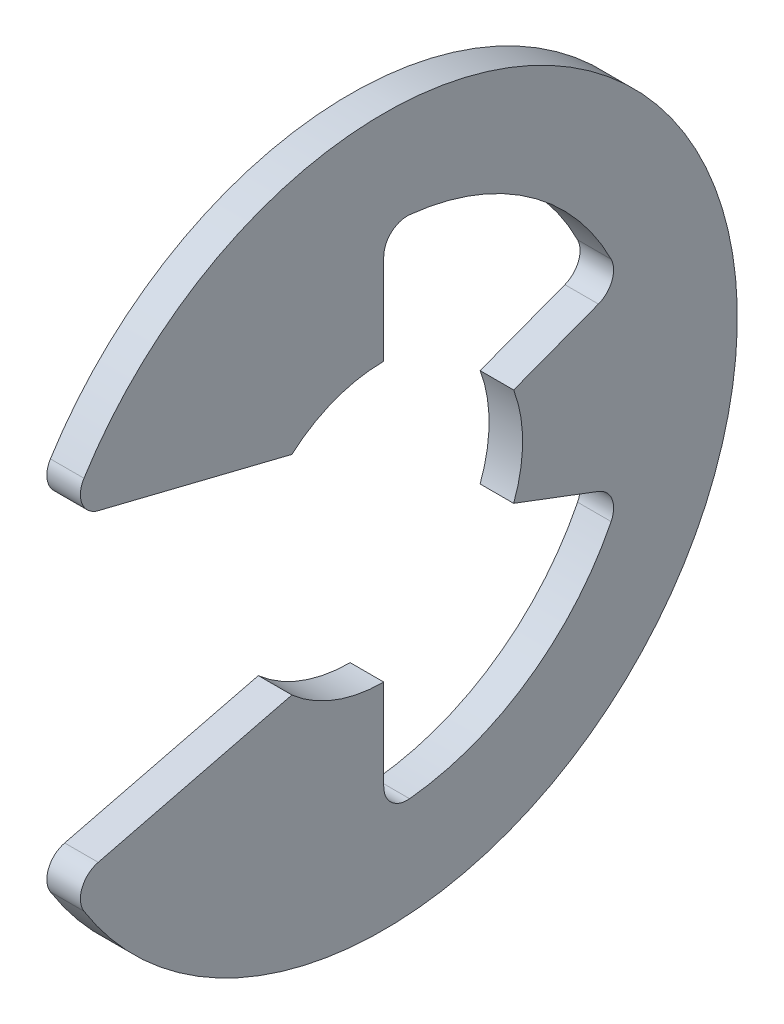
ISO-10303-21;
HEADER;
FILE_DESCRIPTION(('STEP AP214'),'2;1');
FILE_NAME('part.step','',(''),(''),'','','');
FILE_SCHEMA(('AUTOMOTIVE_DESIGN { 1 0 10303 214 1 1 1 1 }'));
ENDSEC;
DATA;
#1=APPLICATION_CONTEXT('core data for automotive mechanical design processes');
#2=APPLICATION_PROTOCOL_DEFINITION('international standard','automotive_design',2000,#1);
#3=PRODUCT_CONTEXT('',#1,'mechanical');
#4=PRODUCT('Part','Part','',(#3));
#5=PRODUCT_RELATED_PRODUCT_CATEGORY('part','',(#4));
#6=PRODUCT_DEFINITION_FORMATION('','',#4);
#7=PRODUCT_DEFINITION_CONTEXT('part definition',#1,'design');
#8=PRODUCT_DEFINITION('design','',#6,#7);
#9=PRODUCT_DEFINITION_SHAPE('','',#8);
#10=(LENGTH_UNIT() NAMED_UNIT(*) SI_UNIT(.MILLI.,.METRE.));
#11=(NAMED_UNIT(*) PLANE_ANGLE_UNIT() SI_UNIT($,.RADIAN.));
#12=(NAMED_UNIT(*) SI_UNIT($,.STERADIAN.) SOLID_ANGLE_UNIT());
#13=UNCERTAINTY_MEASURE_WITH_UNIT(LENGTH_MEASURE(1.E-05),#10,'distance_accuracy_value','');
#14=(GEOMETRIC_REPRESENTATION_CONTEXT(3) GLOBAL_UNCERTAINTY_ASSIGNED_CONTEXT((#13)) GLOBAL_UNIT_ASSIGNED_CONTEXT((#10,
#11,#12)) REPRESENTATION_CONTEXT('',''));
#15=CARTESIAN_POINT('',(0.,0.,0.));
#16=DIRECTION('',(0.,0.,1.));
#17=DIRECTION('',(1.,0.,0.));
#18=AXIS2_PLACEMENT_3D('',#15,#16,#17);
#19=CARTESIAN_POINT('',(0.3175,0.,0.));
#20=DIRECTION('',(-1.,0.,0.));
#21=DIRECTION('',(0.,0.,1.));
#22=AXIS2_PLACEMENT_3D('',#19,#20,#21);
#23=CYLINDRICAL_SURFACE('',#22,6.6929);
#24=CARTESIAN_POINT('',(0.3175,0.,0.));
#25=DIRECTION('',(1.,0.,0.));
#26=DIRECTION('',(0.,0.,-1.));
#27=AXIS2_PLACEMENT_3D('',#24,#25,#26);
#28=CIRCLE('',#27,6.6929);
#29=CARTESIAN_POINT('',(0.3175,-3.54889999540933,5.67452370094475));
#30=VERTEX_POINT('',#29);
#31=CARTESIAN_POINT('',(0.3175,3.54889999540933,5.67452370094475));
#32=VERTEX_POINT('',#31);
#33=EDGE_CURVE('E181',#30,#32,#28,.T.);
#34=ORIENTED_EDGE('',*,*,#33,.F.);
#35=DIRECTION('',(-1.,0.,0.));
#36=VECTOR('',#35,1.);
#37=CARTESIAN_POINT('',(0.3175,-3.54889999540933,5.67452370094475));
#38=LINE('',#37,#36);
#39=CARTESIAN_POINT('',(-0.3175,-3.54889999540933,5.67452370094475));
#40=VERTEX_POINT('',#39);
#41=EDGE_CURVE('E275',#30,#40,#38,.T.);
#42=ORIENTED_EDGE('',*,*,#41,.T.);
#43=CARTESIAN_POINT('',(-0.3175,0.,0.));
#44=DIRECTION('',(1.,0.,0.));
#45=DIRECTION('',(0.,0.,-1.));
#46=AXIS2_PLACEMENT_3D('',#43,#44,#45);
#47=CIRCLE('',#46,6.6929);
#48=CARTESIAN_POINT('',(-0.3175,3.54889999540933,5.67452370094475));
#49=VERTEX_POINT('',#48);
#50=EDGE_CURVE('E219',#40,#49,#47,.T.);
#51=ORIENTED_EDGE('',*,*,#50,.T.);
#52=DIRECTION('',(-1.,0.,0.));
#53=VECTOR('',#52,1.);
#54=CARTESIAN_POINT('',(0.3175,3.54889999540933,5.67452370094475));
#55=LINE('',#54,#53);
#56=EDGE_CURVE('E273',#49,#32,#55,.F.);
#57=ORIENTED_EDGE('',*,*,#56,.T.);
#58=EDGE_LOOP('',(#34,#42,#51,#57));
#59=FACE_BOUND('',#58,.T.);
#60=ADVANCED_FACE('F43',(#59),#23,.T.);
#61=CARTESIAN_POINT('',(0.3175,3.02251427254246,5.97154233697435));
#62=DIRECTION('',(0.,0.970536829925373,-0.240952820606872));
#63=DIRECTION('',(0.,0.240952820606872,0.970536829925373));
#64=AXIS2_PLACEMENT_3D('',#61,#62,#63);
#65=PLANE('',#64);
#66=DIRECTION('',(0.,-0.240952820606872,-0.970536829925373));
#67=VECTOR('',#66,1.);
#68=CARTESIAN_POINT('',(0.3175,3.02251427254246,5.97154233697435));
#69=LINE('',#68,#67);
#70=CARTESIAN_POINT('',(0.3175,2.88180092889208,5.40476132926225));
#71=VERTEX_POINT('',#70);
#72=CARTESIAN_POINT('',(0.3175,1.971675,1.73885390541443));
#73=VERTEX_POINT('',#72);
#74=EDGE_CURVE('E167',#71,#73,#69,.T.);
#75=ORIENTED_EDGE('',*,*,#74,.F.);
#76=DIRECTION('',(-1.,0.,0.));
#77=VECTOR('',#76,1.);
#78=CARTESIAN_POINT('',(0.3175,2.88180092889208,5.40476132926225));
#79=LINE('',#78,#77);
#80=CARTESIAN_POINT('',(-0.3175,2.88180092889208,5.40476132926225));
#81=VERTEX_POINT('',#80);
#82=EDGE_CURVE('E287',#71,#81,#79,.T.);
#83=ORIENTED_EDGE('',*,*,#82,.T.);
#84=DIRECTION('',(0.,-0.240952820606872,-0.970536829925373));
#85=VECTOR('',#84,1.);
#86=CARTESIAN_POINT('',(-0.3175,3.02251427254246,5.97154233697435));
#87=LINE('',#86,#85);
#88=CARTESIAN_POINT('',(-0.3175,1.971675,1.73885390541443));
#89=VERTEX_POINT('',#88);
#90=EDGE_CURVE('E187',#81,#89,#87,.T.);
#91=ORIENTED_EDGE('',*,*,#90,.T.);
#92=DIRECTION('',(-1.,0.,0.));
#93=VECTOR('',#92,1.);
#94=CARTESIAN_POINT('',(0.3175,1.971675,1.73885390541443));
#95=LINE('',#94,#93);
#96=EDGE_CURVE('E184',#73,#89,#95,.T.);
#97=ORIENTED_EDGE('',*,*,#96,.F.);
#98=EDGE_LOOP('',(#75,#83,#91,#97));
#99=FACE_BOUND('',#98,.T.);
#100=ADVANCED_FACE('F185',(#99),#65,.F.);
#101=CARTESIAN_POINT('',(0.3175,0.,0.));
#102=DIRECTION('',(-1.,0.,0.));
#103=DIRECTION('',(0.,0.,1.));
#104=AXIS2_PLACEMENT_3D('',#101,#102,#103);
#105=CYLINDRICAL_SURFACE('',#104,2.6289);
#106=CARTESIAN_POINT('',(-0.3175,0.,0.));
#107=DIRECTION('',(-1.,0.,0.));
#108=DIRECTION('',(0.,0.,1.));
#109=AXIS2_PLACEMENT_3D('',#106,#107,#108);
#110=CIRCLE('',#109,2.6289);
#111=CARTESIAN_POINT('',(-0.3175,2.6289,0.));
#112=VERTEX_POINT('',#111);
#113=EDGE_CURVE('E223',#89,#112,#110,.T.);
#114=ORIENTED_EDGE('',*,*,#113,.T.);
#115=DIRECTION('',(-1.,0.,0.));
#116=VECTOR('',#115,1.);
#117=CARTESIAN_POINT('',(0.3175,2.6289,0.));
#118=LINE('',#117,#116);
#119=CARTESIAN_POINT('',(0.3175,2.6289,0.));
#120=VERTEX_POINT('',#119);
#121=EDGE_CURVE('E191',#120,#112,#118,.T.);
#122=ORIENTED_EDGE('',*,*,#121,.F.);
#123=CARTESIAN_POINT('',(0.3175,0.,0.));
#124=DIRECTION('',(-1.,0.,0.));
#125=DIRECTION('',(0.,0.,1.));
#126=AXIS2_PLACEMENT_3D('',#123,#124,#125);
#127=CIRCLE('',#126,2.6289);
#128=EDGE_CURVE('E173',#73,#120,#127,.T.);
#129=ORIENTED_EDGE('',*,*,#128,.F.);
#130=ORIENTED_EDGE('',*,*,#96,.T.);
#131=EDGE_LOOP('',(#114,#122,#129,#130));
#132=FACE_BOUND('',#131,.T.);
#133=ADVANCED_FACE('F193',(#132),#105,.F.);
#134=CARTESIAN_POINT('',(0.3175,2.6289,0.));
#135=DIRECTION('',(0.,0.,1.));
#136=DIRECTION('',(0.,-1.,0.));
#137=AXIS2_PLACEMENT_3D('',#134,#135,#136);
#138=PLANE('',#137);
#139=DIRECTION('',(0.,1.,0.));
#140=VECTOR('',#139,1.);
#141=CARTESIAN_POINT('',(-0.3175,2.6289,0.));
#142=LINE('',#141,#140);
#143=CARTESIAN_POINT('',(-0.3175,4.34406945142374,0.));
#144=VERTEX_POINT('',#143);
#145=EDGE_CURVE('E225',#112,#144,#142,.T.);
#146=ORIENTED_EDGE('',*,*,#145,.T.);
#147=DIRECTION('',(1.,0.,0.));
#148=VECTOR('',#147,1.);
#149=CARTESIAN_POINT('',(0.3175,4.34406945142374,0.));
#150=LINE('',#149,#148);
#151=CARTESIAN_POINT('',(0.3175,4.34406945142374,0.));
#152=VERTEX_POINT('',#151);
#153=EDGE_CURVE('E271',#144,#152,#150,.T.);
#154=ORIENTED_EDGE('',*,*,#153,.T.);
#155=DIRECTION('',(0.,1.,0.));
#156=VECTOR('',#155,1.);
#157=CARTESIAN_POINT('',(0.3175,2.6289,0.));
#158=LINE('',#157,#156);
#159=EDGE_CURVE('E196',#120,#152,#158,.T.);
#160=ORIENTED_EDGE('',*,*,#159,.F.);
#161=ORIENTED_EDGE('',*,*,#121,.T.);
#162=EDGE_LOOP('',(#146,#154,#160,#161));
#163=FACE_BOUND('',#162,.T.);
#164=ADVANCED_FACE('F393',(#163),#138,.F.);
#165=CARTESIAN_POINT('',(0.3175,0.,0.));
#166=DIRECTION('',(-1.,0.,0.));
#167=DIRECTION('',(0.,0.,1.));
#168=AXIS2_PLACEMENT_3D('',#165,#166,#167);
#169=CYLINDRICAL_SURFACE('',#168,4.81125161290323);
#170=CARTESIAN_POINT('',(0.3175,0.,0.));
#171=DIRECTION('',(-1.,0.,0.));
#172=DIRECTION('',(0.,0.,-1.));
#173=AXIS2_PLACEMENT_3D('',#170,#171,#172);
#174=CIRCLE('',#173,4.81125161290323);
#175=CARTESIAN_POINT('',(0.3175,4.78626059081718,-0.489746505300684));
#176=VERTEX_POINT('',#175);
#177=CARTESIAN_POINT('',(0.3175,2.15031456744764,-4.30398528618377));
#178=VERTEX_POINT('',#177);
#179=EDGE_CURVE('E198',#176,#178,#174,.T.);
#180=ORIENTED_EDGE('',*,*,#179,.F.);
#181=DIRECTION('',(-1.,0.,0.));
#182=VECTOR('',#181,1.);
#183=CARTESIAN_POINT('',(0.3175,4.78626059081718,-0.489746505300684));
#184=LINE('',#183,#182);
#185=CARTESIAN_POINT('',(-0.3175,4.78626059081718,-0.489746505300684));
#186=VERTEX_POINT('',#185);
#187=EDGE_CURVE('E268',#176,#186,#184,.T.);
#188=ORIENTED_EDGE('',*,*,#187,.T.);
#189=CARTESIAN_POINT('',(-0.3175,0.,0.));
#190=DIRECTION('',(-1.,0.,0.));
#191=DIRECTION('',(0.,0.,-1.));
#192=AXIS2_PLACEMENT_3D('',#189,#190,#191);
#193=CIRCLE('',#192,4.81125161290323);
#194=CARTESIAN_POINT('',(-0.3175,2.15031456744764,-4.30398528618377));
#195=VERTEX_POINT('',#194);
#196=EDGE_CURVE('E228',#186,#195,#193,.T.);
#197=ORIENTED_EDGE('',*,*,#196,.T.);
#198=DIRECTION('',(-1.,0.,0.));
#199=VECTOR('',#198,1.);
#200=CARTESIAN_POINT('',(0.3175,2.15031456744764,-4.30398528618377));
#201=LINE('',#200,#199);
#202=EDGE_CURVE('E266',#195,#178,#201,.F.);
#203=ORIENTED_EDGE('',*,*,#202,.T.);
#204=EDGE_LOOP('',(#180,#188,#197,#203));
#205=FACE_BOUND('',#204,.T.);
#206=ADVANCED_FACE('F315',(#205),#169,.F.);
#207=CARTESIAN_POINT('',(0.3175,0.929456508530657,-2.4591107760225));
#208=DIRECTION('',(0.,-0.935414346693485,-0.353553390593274));
#209=DIRECTION('',(0.,0.353553390593274,-0.935414346693485));
#210=AXIS2_PLACEMENT_3D('',#207,#208,#209);
#211=PLANE('',#210);
#212=DIRECTION('',(0.,-0.353553390593274,0.935414346693485));
#213=VECTOR('',#212,1.);
#214=CARTESIAN_POINT('',(0.3175,0.929456508530657,-2.4591107760225));
#215=LINE('',#214,#213);
#216=CARTESIAN_POINT('',(0.3175,1.53586048352353,-4.06350488789466));
#217=VERTEX_POINT('',#216);
#218=CARTESIAN_POINT('',(0.3175,0.929456508530657,-2.4591107760225));
#219=VERTEX_POINT('',#218);
#220=EDGE_CURVE('E203',#217,#219,#215,.T.);
#221=ORIENTED_EDGE('',*,*,#220,.F.);
#222=DIRECTION('',(1.,0.,0.));
#223=VECTOR('',#222,1.);
#224=CARTESIAN_POINT('',(-0.3175,1.53586048352353,-4.06350488789466));
#225=LINE('',#224,#223);
#226=CARTESIAN_POINT('',(-0.3175,1.53586048352353,-4.06350488789466));
#227=VERTEX_POINT('',#226);
#228=EDGE_CURVE('E290',#217,#227,#225,.F.);
#229=ORIENTED_EDGE('',*,*,#228,.T.);
#230=DIRECTION('',(0.,-0.353553390593274,0.935414346693485));
#231=VECTOR('',#230,1.);
#232=CARTESIAN_POINT('',(-0.3175,0.929456508530657,-2.4591107760225));
#233=LINE('',#232,#231);
#234=CARTESIAN_POINT('',(-0.3175,0.929456508530657,-2.4591107760225));
#235=VERTEX_POINT('',#234);
#236=EDGE_CURVE('E231',#227,#235,#233,.T.);
#237=ORIENTED_EDGE('',*,*,#236,.T.);
#238=DIRECTION('',(-1.,0.,0.));
#239=VECTOR('',#238,1.);
#240=CARTESIAN_POINT('',(0.3175,0.929456508530657,-2.4591107760225));
#241=LINE('',#240,#239);
#242=EDGE_CURVE('E255',#219,#235,#241,.T.);
#243=ORIENTED_EDGE('',*,*,#242,.F.);
#244=EDGE_LOOP('',(#221,#229,#237,#243));
#245=FACE_BOUND('',#244,.T.);
#246=ADVANCED_FACE('F318',(#245),#211,.F.);
#247=CARTESIAN_POINT('',(0.3175,0.,0.));
#248=DIRECTION('',(-1.,0.,0.));
#249=DIRECTION('',(0.,0.,1.));
#250=AXIS2_PLACEMENT_3D('',#247,#248,#249);
#251=CYLINDRICAL_SURFACE('',#250,2.6289);
#252=CARTESIAN_POINT('',(-0.3175,0.,0.));
#253=DIRECTION('',(-1.,0.,0.));
#254=DIRECTION('',(0.,0.,1.));
#255=AXIS2_PLACEMENT_3D('',#252,#253,#254);
#256=CIRCLE('',#255,2.6289);
#257=CARTESIAN_POINT('',(-0.3175,-0.929456508530657,-2.4591107760225));
#258=VERTEX_POINT('',#257);
#259=EDGE_CURVE('E233',#235,#258,#256,.T.);
#260=ORIENTED_EDGE('',*,*,#259,.T.);
#261=DIRECTION('',(-1.,0.,0.));
#262=VECTOR('',#261,1.);
#263=CARTESIAN_POINT('',(0.3175,-0.929456508530657,-2.4591107760225));
#264=LINE('',#263,#262);
#265=CARTESIAN_POINT('',(0.3175,-0.929456508530657,-2.4591107760225));
#266=VERTEX_POINT('',#265);
#267=EDGE_CURVE('E252',#266,#258,#264,.T.);
#268=ORIENTED_EDGE('',*,*,#267,.F.);
#269=CARTESIAN_POINT('',(0.3175,0.,0.));
#270=DIRECTION('',(-1.,0.,0.));
#271=DIRECTION('',(0.,0.,1.));
#272=AXIS2_PLACEMENT_3D('',#269,#270,#271);
#273=CIRCLE('',#272,2.6289);
#274=EDGE_CURVE('E205',#219,#266,#273,.T.);
#275=ORIENTED_EDGE('',*,*,#274,.F.);
#276=ORIENTED_EDGE('',*,*,#242,.T.);
#277=EDGE_LOOP('',(#260,#268,#275,#276));
#278=FACE_BOUND('',#277,.T.);
#279=ADVANCED_FACE('F324',(#278),#251,.F.);
#280=CARTESIAN_POINT('',(0.3175,-0.929456508530657,-2.4591107760225));
#281=DIRECTION('',(0.,0.935414346693485,-0.353553390593274));
#282=DIRECTION('',(0.,0.353553390593274,0.935414346693485));
#283=AXIS2_PLACEMENT_3D('',#280,#281,#282);
#284=PLANE('',#283);
#285=DIRECTION('',(0.,-0.353553390593274,-0.935414346693485));
#286=VECTOR('',#285,1.);
#287=CARTESIAN_POINT('',(-0.3175,-0.929456508530657,-2.4591107760225));
#288=LINE('',#287,#286);
#289=CARTESIAN_POINT('',(-0.3175,-1.53586048352352,-4.06350488789466));
#290=VERTEX_POINT('',#289);
#291=EDGE_CURVE('E235',#258,#290,#288,.T.);
#292=ORIENTED_EDGE('',*,*,#291,.T.);
#293=DIRECTION('',(1.,0.,0.));
#294=VECTOR('',#293,1.);
#295=CARTESIAN_POINT('',(0.3175,-1.53586048352352,-4.06350488789466));
#296=LINE('',#295,#294);
#297=CARTESIAN_POINT('',(0.3175,-1.53586048352352,-4.06350488789466));
#298=VERTEX_POINT('',#297);
#299=EDGE_CURVE('E58',#290,#298,#296,.T.);
#300=ORIENTED_EDGE('',*,*,#299,.T.);
#301=DIRECTION('',(0.,-0.353553390593274,-0.935414346693485));
#302=VECTOR('',#301,1.);
#303=CARTESIAN_POINT('',(0.3175,-0.929456508530657,-2.4591107760225));
#304=LINE('',#303,#302);
#305=EDGE_CURVE('E207',#266,#298,#304,.T.);
#306=ORIENTED_EDGE('',*,*,#305,.F.);
#307=ORIENTED_EDGE('',*,*,#267,.T.);
#308=EDGE_LOOP('',(#292,#300,#306,#307));
#309=FACE_BOUND('',#308,.T.);
#310=ADVANCED_FACE('F326',(#309),#284,.F.);
#311=CARTESIAN_POINT('',(0.3175,0.,0.));
#312=DIRECTION('',(-1.,0.,0.));
#313=DIRECTION('',(0.,0.,1.));
#314=AXIS2_PLACEMENT_3D('',#311,#312,#313);
#315=CYLINDRICAL_SURFACE('',#314,4.81125161290323);
#316=CARTESIAN_POINT('',(-0.3175,0.,0.));
#317=DIRECTION('',(-1.,0.,0.));
#318=DIRECTION('',(0.,0.,-1.));
#319=AXIS2_PLACEMENT_3D('',#316,#317,#318);
#320=CIRCLE('',#319,4.81125161290323);
#321=CARTESIAN_POINT('',(-0.3175,-2.15031456744764,-4.30398528618377));
#322=VERTEX_POINT('',#321);
#323=CARTESIAN_POINT('',(-0.3175,-4.78626059081718,-0.489746505300685));
#324=VERTEX_POINT('',#323);
#325=EDGE_CURVE('E237',#322,#324,#320,.T.);
#326=ORIENTED_EDGE('',*,*,#325,.T.);
#327=DIRECTION('',(-1.,0.,0.));
#328=VECTOR('',#327,1.);
#329=CARTESIAN_POINT('',(0.3175,-4.78626059081718,-0.489746505300685));
#330=LINE('',#329,#328);
#331=CARTESIAN_POINT('',(0.3175,-4.78626059081718,-0.489746505300685));
#332=VERTEX_POINT('',#331);
#333=EDGE_CURVE('E264',#324,#332,#330,.F.);
#334=ORIENTED_EDGE('',*,*,#333,.T.);
#335=CARTESIAN_POINT('',(0.3175,0.,0.));
#336=DIRECTION('',(-1.,0.,0.));
#337=DIRECTION('',(0.,0.,-1.));
#338=AXIS2_PLACEMENT_3D('',#335,#336,#337);
#339=CIRCLE('',#338,4.81125161290323);
#340=CARTESIAN_POINT('',(0.3175,-2.15031456744764,-4.30398528618377));
#341=VERTEX_POINT('',#340);
#342=EDGE_CURVE('E209',#341,#332,#339,.T.);
#343=ORIENTED_EDGE('',*,*,#342,.F.);
#344=DIRECTION('',(-1.,0.,0.));
#345=VECTOR('',#344,1.);
#346=CARTESIAN_POINT('',(0.3175,-2.15031456744764,-4.30398528618377));
#347=LINE('',#346,#345);
#348=EDGE_CURVE('E261',#341,#322,#347,.T.);
#349=ORIENTED_EDGE('',*,*,#348,.T.);
#350=EDGE_LOOP('',(#326,#334,#343,#349));
#351=FACE_BOUND('',#350,.T.);
#352=ADVANCED_FACE('F328',(#351),#315,.F.);
#353=CARTESIAN_POINT('',(0.3175,-2.6289,0.));
#354=DIRECTION('',(0.,0.,1.));
#355=DIRECTION('',(0.,-1.,0.));
#356=AXIS2_PLACEMENT_3D('',#353,#354,#355);
#357=PLANE('',#356);
#358=DIRECTION('',(0.,1.,0.));
#359=VECTOR('',#358,1.);
#360=CARTESIAN_POINT('',(0.3175,-2.6289,0.));
#361=LINE('',#360,#359);
#362=CARTESIAN_POINT('',(0.3175,-4.34406945142374,0.));
#363=VERTEX_POINT('',#362);
#364=CARTESIAN_POINT('',(0.3175,-2.6289,0.));
#365=VERTEX_POINT('',#364);
#366=EDGE_CURVE('E212',#363,#365,#361,.T.);
#367=ORIENTED_EDGE('',*,*,#366,.F.);
#368=DIRECTION('',(1.,0.,0.));
#369=VECTOR('',#368,1.);
#370=CARTESIAN_POINT('',(-0.3175,-4.34406945142374,0.));
#371=LINE('',#370,#369);
#372=CARTESIAN_POINT('',(-0.3175,-4.34406945142374,0.));
#373=VERTEX_POINT('',#372);
#374=EDGE_CURVE('E190',#363,#373,#371,.F.);
#375=ORIENTED_EDGE('',*,*,#374,.T.);
#376=DIRECTION('',(0.,1.,0.));
#377=VECTOR('',#376,1.);
#378=CARTESIAN_POINT('',(-0.3175,-2.6289,0.));
#379=LINE('',#378,#377);
#380=CARTESIAN_POINT('',(-0.3175,-2.6289,0.));
#381=VERTEX_POINT('',#380);
#382=EDGE_CURVE('E240',#373,#381,#379,.T.);
#383=ORIENTED_EDGE('',*,*,#382,.T.);
#384=DIRECTION('',(-1.,0.,0.));
#385=VECTOR('',#384,1.);
#386=CARTESIAN_POINT('',(0.3175,-2.6289,0.));
#387=LINE('',#386,#385);
#388=EDGE_CURVE('E249',#365,#381,#387,.T.);
#389=ORIENTED_EDGE('',*,*,#388,.F.);
#390=EDGE_LOOP('',(#367,#375,#383,#389));
#391=FACE_BOUND('',#390,.T.);
#392=ADVANCED_FACE('F334',(#391),#357,.F.);
#393=CARTESIAN_POINT('',(0.3175,0.,0.));
#394=DIRECTION('',(-1.,0.,0.));
#395=DIRECTION('',(0.,0.,1.));
#396=AXIS2_PLACEMENT_3D('',#393,#394,#395);
#397=CYLINDRICAL_SURFACE('',#396,2.6289);
#398=CARTESIAN_POINT('',(-0.3175,0.,0.));
#399=DIRECTION('',(-1.,0.,0.));
#400=DIRECTION('',(0.,0.,-1.));
#401=AXIS2_PLACEMENT_3D('',#398,#399,#400);
#402=CIRCLE('',#401,2.6289);
#403=CARTESIAN_POINT('',(-0.3175,-1.971675,1.73885390541443));
#404=VERTEX_POINT('',#403);
#405=EDGE_CURVE('E242',#381,#404,#402,.T.);
#406=ORIENTED_EDGE('',*,*,#405,.T.);
#407=DIRECTION('',(-1.,0.,0.));
#408=VECTOR('',#407,1.);
#409=CARTESIAN_POINT('',(0.3175,-1.971675,1.73885390541443));
#410=LINE('',#409,#408);
#411=CARTESIAN_POINT('',(0.3175,-1.971675,1.73885390541443));
#412=VERTEX_POINT('',#411);
#413=EDGE_CURVE('E218',#412,#404,#410,.T.);
#414=ORIENTED_EDGE('',*,*,#413,.F.);
#415=CARTESIAN_POINT('',(0.3175,0.,0.));
#416=DIRECTION('',(-1.,0.,0.));
#417=DIRECTION('',(0.,0.,-1.));
#418=AXIS2_PLACEMENT_3D('',#415,#416,#417);
#419=CIRCLE('',#418,2.6289);
#420=EDGE_CURVE('E214',#365,#412,#419,.T.);
#421=ORIENTED_EDGE('',*,*,#420,.F.);
#422=ORIENTED_EDGE('',*,*,#388,.T.);
#423=EDGE_LOOP('',(#406,#414,#421,#422));
#424=FACE_BOUND('',#423,.T.);
#425=ADVANCED_FACE('F383',(#424),#397,.F.);
#426=CARTESIAN_POINT('',(0.3175,-3.02251427254246,5.97154233697435));
#427=DIRECTION('',(0.,-0.970536829925373,-0.240952820606873));
#428=DIRECTION('',(0.,0.240952820606873,-0.970536829925373));
#429=AXIS2_PLACEMENT_3D('',#426,#427,#428);
#430=PLANE('',#429);
#431=DIRECTION('',(0.,-0.240952820606873,0.970536829925373));
#432=VECTOR('',#431,1.);
#433=CARTESIAN_POINT('',(-0.3175,-3.02251427254246,5.97154233697435));
#434=LINE('',#433,#432);
#435=CARTESIAN_POINT('',(-0.3175,-2.88180092889208,5.40476132926225));
#436=VERTEX_POINT('',#435);
#437=EDGE_CURVE('E244',#404,#436,#434,.T.);
#438=ORIENTED_EDGE('',*,*,#437,.T.);
#439=DIRECTION('',(-1.,0.,0.));
#440=VECTOR('',#439,1.);
#441=CARTESIAN_POINT('',(0.3175,-2.88180092889208,5.40476132926225));
#442=LINE('',#441,#440);
#443=CARTESIAN_POINT('',(0.3175,-2.88180092889208,5.40476132926225));
#444=VERTEX_POINT('',#443);
#445=EDGE_CURVE('E282',#436,#444,#442,.F.);
#446=ORIENTED_EDGE('',*,*,#445,.T.);
#447=DIRECTION('',(0.,-0.240952820606873,0.970536829925373));
#448=VECTOR('',#447,1.);
#449=CARTESIAN_POINT('',(0.3175,-3.02251427254246,5.97154233697435));
#450=LINE('',#449,#448);
#451=EDGE_CURVE('E216',#412,#444,#450,.T.);
#452=ORIENTED_EDGE('',*,*,#451,.F.);
#453=ORIENTED_EDGE('',*,*,#413,.T.);
#454=EDGE_LOOP('',(#438,#446,#452,#453));
#455=FACE_BOUND('',#454,.T.);
#456=ADVANCED_FACE('F432',(#455),#430,.F.);
#457=CARTESIAN_POINT('',(0.3175,0.,0.));
#458=DIRECTION('',(1.,0.,0.));
#459=DIRECTION('',(0.,0.,-1.));
#460=AXIS2_PLACEMENT_3D('',#457,#458,#459);
#461=PLANE('',#460);
#462=ORIENTED_EDGE('',*,*,#451,.T.);
#463=CARTESIAN_POINT('',(0.3175,-3.31320454979391,5.29765780050249));
#464=DIRECTION('',(1.,0.,0.));
#465=DIRECTION('',(0.,0.,-1.));
#466=AXIS2_PLACEMENT_3D('',#463,#464,#465);
#467=CIRCLE('',#466,0.4445);
#468=EDGE_CURVE('E285',#444,#30,#467,.T.);
#469=ORIENTED_EDGE('',*,*,#468,.T.);
#470=ORIENTED_EDGE('',*,*,#33,.T.);
#471=CARTESIAN_POINT('',(0.3175,3.31320454979391,5.2976578005025));
#472=DIRECTION('',(1.,0.,0.));
#473=DIRECTION('',(0.,0.,-1.));
#474=AXIS2_PLACEMENT_3D('',#471,#472,#473);
#475=CIRCLE('',#474,0.4445);
#476=EDGE_CURVE('E177',#32,#71,#475,.T.);
#477=ORIENTED_EDGE('',*,*,#476,.T.);
#478=ORIENTED_EDGE('',*,*,#74,.T.);
#479=ORIENTED_EDGE('',*,*,#128,.T.);
#480=ORIENTED_EDGE('',*,*,#159,.T.);
#481=CARTESIAN_POINT('',(0.3175,4.34406945142374,-0.444499999999999));
#482=DIRECTION('',(1.,0.,0.));
#483=DIRECTION('',(0.,0.,-1.));
#484=AXIS2_PLACEMENT_3D('',#481,#482,#483);
#485=CIRCLE('',#484,0.4445);
#486=EDGE_CURVE('E299',#152,#176,#485,.F.);
#487=ORIENTED_EDGE('',*,*,#486,.T.);
#488=ORIENTED_EDGE('',*,*,#179,.T.);
#489=CARTESIAN_POINT('',(0.3175,1.95165216062878,-3.90635040577595));
#490=DIRECTION('',(1.,0.,0.));
#491=DIRECTION('',(0.,0.,-1.));
#492=AXIS2_PLACEMENT_3D('',#489,#490,#491);
#493=CIRCLE('',#492,0.4445);
#494=EDGE_CURVE('E13',#178,#217,#493,.F.);
#495=ORIENTED_EDGE('',*,*,#494,.T.);
#496=ORIENTED_EDGE('',*,*,#220,.T.);
#497=ORIENTED_EDGE('',*,*,#274,.T.);
#498=ORIENTED_EDGE('',*,*,#305,.T.);
#499=CARTESIAN_POINT('',(0.3175,-1.95165216062878,-3.90635040577595));
#500=DIRECTION('',(1.,0.,0.));
#501=DIRECTION('',(0.,0.,-1.));
#502=AXIS2_PLACEMENT_3D('',#499,#500,#501);
#503=CIRCLE('',#502,0.4445);
#504=EDGE_CURVE('E303',#298,#341,#503,.F.);
#505=ORIENTED_EDGE('',*,*,#504,.T.);
#506=ORIENTED_EDGE('',*,*,#342,.T.);
#507=CARTESIAN_POINT('',(0.3175,-4.34406945142374,-0.4445));
#508=DIRECTION('',(1.,0.,0.));
#509=DIRECTION('',(0.,0.,-1.));
#510=AXIS2_PLACEMENT_3D('',#507,#508,#509);
#511=CIRCLE('',#510,0.4445);
#512=EDGE_CURVE('E295',#332,#363,#511,.F.);
#513=ORIENTED_EDGE('',*,*,#512,.T.);
#514=ORIENTED_EDGE('',*,*,#366,.T.);
#515=ORIENTED_EDGE('',*,*,#420,.T.);
#516=EDGE_LOOP('',(#462,#469,#470,#477,#478,#479,#480,#487,#488,#495,#496,#497,#498,#505,#506,
#513,#514,#515));
#517=FACE_BOUND('',#516,.T.);
#518=ADVANCED_FACE('F170',(#517),#461,.T.);
#519=CARTESIAN_POINT('',(-0.3175,0.,0.));
#520=DIRECTION('',(1.,0.,0.));
#521=DIRECTION('',(0.,0.,-1.));
#522=AXIS2_PLACEMENT_3D('',#519,#520,#521);
#523=PLANE('',#522);
#524=ORIENTED_EDGE('',*,*,#50,.F.);
#525=CARTESIAN_POINT('',(-0.3175,-3.31320454979391,5.29765780050249));
#526=DIRECTION('',(1.,0.,0.));
#527=DIRECTION('',(0.,0.,-1.));
#528=AXIS2_PLACEMENT_3D('',#525,#526,#527);
#529=CIRCLE('',#528,0.4445);
#530=EDGE_CURVE('E280',#40,#436,#529,.F.);
#531=ORIENTED_EDGE('',*,*,#530,.T.);
#532=ORIENTED_EDGE('',*,*,#437,.F.);
#533=ORIENTED_EDGE('',*,*,#405,.F.);
#534=ORIENTED_EDGE('',*,*,#382,.F.);
#535=CARTESIAN_POINT('',(-0.3175,-4.34406945142374,-0.4445));
#536=DIRECTION('',(1.,0.,0.));
#537=DIRECTION('',(0.,0.,-1.));
#538=AXIS2_PLACEMENT_3D('',#535,#536,#537);
#539=CIRCLE('',#538,0.4445);
#540=EDGE_CURVE('E293',#373,#324,#539,.T.);
#541=ORIENTED_EDGE('',*,*,#540,.T.);
#542=ORIENTED_EDGE('',*,*,#325,.F.);
#543=CARTESIAN_POINT('',(-0.3175,-1.95165216062878,-3.90635040577595));
#544=DIRECTION('',(1.,0.,0.));
#545=DIRECTION('',(0.,0.,-1.));
#546=AXIS2_PLACEMENT_3D('',#543,#544,#545);
#547=CIRCLE('',#546,0.4445);
#548=EDGE_CURVE('E301',#322,#290,#547,.T.);
#549=ORIENTED_EDGE('',*,*,#548,.T.);
#550=ORIENTED_EDGE('',*,*,#291,.F.);
#551=ORIENTED_EDGE('',*,*,#259,.F.);
#552=ORIENTED_EDGE('',*,*,#236,.F.);
#553=CARTESIAN_POINT('',(-0.3175,1.95165216062878,-3.90635040577595));
#554=DIRECTION('',(1.,0.,0.));
#555=DIRECTION('',(0.,0.,-1.));
#556=AXIS2_PLACEMENT_3D('',#553,#554,#555);
#557=CIRCLE('',#556,0.4445);
#558=EDGE_CURVE('E51',#227,#195,#557,.T.);
#559=ORIENTED_EDGE('',*,*,#558,.T.);
#560=ORIENTED_EDGE('',*,*,#196,.F.);
#561=CARTESIAN_POINT('',(-0.3175,4.34406945142374,-0.444499999999999));
#562=DIRECTION('',(1.,0.,0.));
#563=DIRECTION('',(0.,0.,-1.));
#564=AXIS2_PLACEMENT_3D('',#561,#562,#563);
#565=CIRCLE('',#564,0.4445);
#566=EDGE_CURVE('E297',#186,#144,#565,.T.);
#567=ORIENTED_EDGE('',*,*,#566,.T.);
#568=ORIENTED_EDGE('',*,*,#145,.F.);
#569=ORIENTED_EDGE('',*,*,#113,.F.);
#570=ORIENTED_EDGE('',*,*,#90,.F.);
#571=CARTESIAN_POINT('',(-0.3175,3.31320454979391,5.2976578005025));
#572=DIRECTION('',(1.,0.,0.));
#573=DIRECTION('',(0.,0.,-1.));
#574=AXIS2_PLACEMENT_3D('',#571,#572,#573);
#575=CIRCLE('',#574,0.4445);
#576=EDGE_CURVE('E278',#81,#49,#575,.F.);
#577=ORIENTED_EDGE('',*,*,#576,.T.);
#578=EDGE_LOOP('',(#524,#531,#532,#533,#534,#541,#542,#549,#550,#551,#552,#559,#560,#567,#568,
#569,#570,#577));
#579=FACE_BOUND('',#578,.T.);
#580=ADVANCED_FACE('F308',(#579),#523,.F.);
#581=CARTESIAN_POINT('',(0.3175,-4.34406945142374,-0.4445));
#582=DIRECTION('',(-1.,0.,0.));
#583=DIRECTION('',(0.,0.,1.));
#584=AXIS2_PLACEMENT_3D('',#581,#582,#583);
#585=CYLINDRICAL_SURFACE('',#584,0.4445);
#586=ORIENTED_EDGE('',*,*,#512,.F.);
#587=ORIENTED_EDGE('',*,*,#333,.F.);
#588=ORIENTED_EDGE('',*,*,#540,.F.);
#589=ORIENTED_EDGE('',*,*,#374,.F.);
#590=EDGE_LOOP('',(#586,#587,#588,#589));
#591=FACE_BOUND('',#590,.T.);
#592=ADVANCED_FACE('F348',(#591),#585,.F.);
#593=CARTESIAN_POINT('',(0.3175,4.34406945142374,-0.444499999999999));
#594=DIRECTION('',(-1.,0.,0.));
#595=DIRECTION('',(0.,0.,1.));
#596=AXIS2_PLACEMENT_3D('',#593,#594,#595);
#597=CYLINDRICAL_SURFACE('',#596,0.4445);
#598=ORIENTED_EDGE('',*,*,#486,.F.);
#599=ORIENTED_EDGE('',*,*,#153,.F.);
#600=ORIENTED_EDGE('',*,*,#566,.F.);
#601=ORIENTED_EDGE('',*,*,#187,.F.);
#602=EDGE_LOOP('',(#598,#599,#600,#601));
#603=FACE_BOUND('',#602,.T.);
#604=ADVANCED_FACE('F351',(#603),#597,.F.);
#605=CARTESIAN_POINT('',(0.3175,-3.31320454979391,5.29765780050249));
#606=DIRECTION('',(-1.,0.,0.));
#607=DIRECTION('',(0.,0.,1.));
#608=AXIS2_PLACEMENT_3D('',#605,#606,#607);
#609=CYLINDRICAL_SURFACE('',#608,0.4445);
#610=ORIENTED_EDGE('',*,*,#468,.F.);
#611=ORIENTED_EDGE('',*,*,#445,.F.);
#612=ORIENTED_EDGE('',*,*,#530,.F.);
#613=ORIENTED_EDGE('',*,*,#41,.F.);
#614=EDGE_LOOP('',(#610,#611,#612,#613));
#615=FACE_BOUND('',#614,.T.);
#616=ADVANCED_FACE('F355',(#615),#609,.T.);
#617=CARTESIAN_POINT('',(0.3175,3.31320454979391,5.2976578005025));
#618=DIRECTION('',(-1.,0.,0.));
#619=DIRECTION('',(0.,0.,1.));
#620=AXIS2_PLACEMENT_3D('',#617,#618,#619);
#621=CYLINDRICAL_SURFACE('',#620,0.4445);
#622=ORIENTED_EDGE('',*,*,#476,.F.);
#623=ORIENTED_EDGE('',*,*,#56,.F.);
#624=ORIENTED_EDGE('',*,*,#576,.F.);
#625=ORIENTED_EDGE('',*,*,#82,.F.);
#626=EDGE_LOOP('',(#622,#623,#624,#625));
#627=FACE_BOUND('',#626,.T.);
#628=ADVANCED_FACE('F359',(#627),#621,.T.);
#629=CARTESIAN_POINT('',(0.3175,-1.95165216062878,-3.90635040577595));
#630=DIRECTION('',(-1.,0.,0.));
#631=DIRECTION('',(0.,0.,1.));
#632=AXIS2_PLACEMENT_3D('',#629,#630,#631);
#633=CYLINDRICAL_SURFACE('',#632,0.4445);
#634=ORIENTED_EDGE('',*,*,#504,.F.);
#635=ORIENTED_EDGE('',*,*,#299,.F.);
#636=ORIENTED_EDGE('',*,*,#548,.F.);
#637=ORIENTED_EDGE('',*,*,#348,.F.);
#638=EDGE_LOOP('',(#634,#635,#636,#637));
#639=FACE_BOUND('',#638,.T.);
#640=ADVANCED_FACE('F362',(#639),#633,.F.);
#641=CARTESIAN_POINT('',(0.3175,1.95165216062878,-3.90635040577595));
#642=DIRECTION('',(-1.,0.,0.));
#643=DIRECTION('',(0.,0.,1.));
#644=AXIS2_PLACEMENT_3D('',#641,#642,#643);
#645=CYLINDRICAL_SURFACE('',#644,0.4445);
#646=ORIENTED_EDGE('',*,*,#494,.F.);
#647=ORIENTED_EDGE('',*,*,#202,.F.);
#648=ORIENTED_EDGE('',*,*,#558,.F.);
#649=ORIENTED_EDGE('',*,*,#228,.F.);
#650=EDGE_LOOP('',(#646,#647,#648,#649));
#651=FACE_BOUND('',#650,.T.);
#652=ADVANCED_FACE('F45',(#651),#645,.F.);
#653=CLOSED_SHELL('',(#60,#100,#133,#164,#206,#246,#279,#310,#352,#392,#425,#456,#518,#580,#592,
#604,#616,#628,#640,#652));
#654=MANIFOLD_SOLID_BREP('B2',#653);
#655=ADVANCED_BREP_SHAPE_REPRESENTATION('',(#18,#654),#14);
#656=SHAPE_DEFINITION_REPRESENTATION(#9,#655);
ENDSEC;
END-ISO-10303-21;
